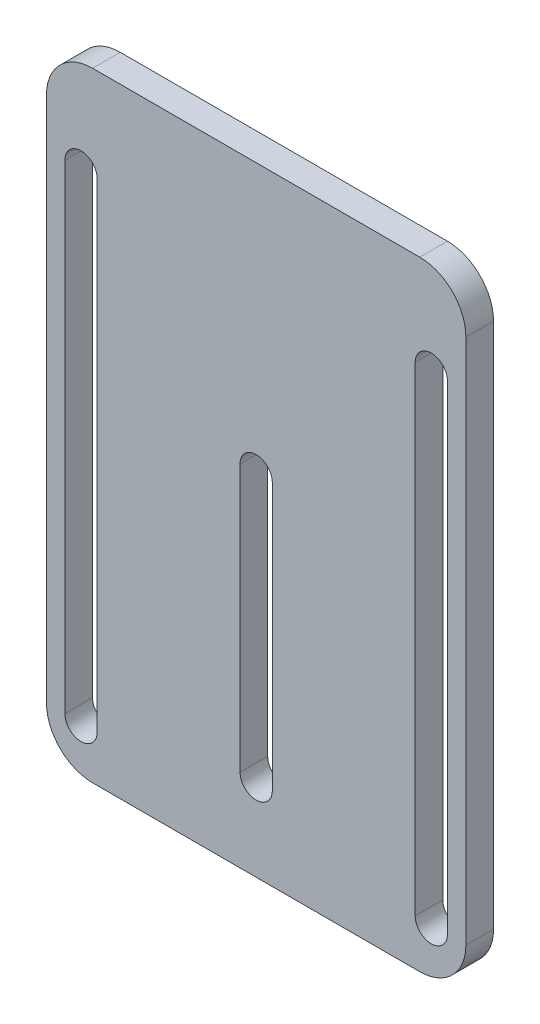
ISO-10303-21;
HEADER;
FILE_DESCRIPTION(('STEP AP214'),'2;1');
FILE_NAME('part.step','',(''),(''),'','','');
FILE_SCHEMA(('AUTOMOTIVE_DESIGN { 1 0 10303 214 1 1 1 1 }'));
ENDSEC;
DATA;
#1=APPLICATION_CONTEXT('core data for automotive mechanical design processes');
#2=APPLICATION_PROTOCOL_DEFINITION('international standard','automotive_design',2000,#1);
#3=PRODUCT_CONTEXT('',#1,'mechanical');
#4=PRODUCT('Part','Part','',(#3));
#5=PRODUCT_RELATED_PRODUCT_CATEGORY('part','',(#4));
#6=PRODUCT_DEFINITION_FORMATION('','',#4);
#7=PRODUCT_DEFINITION_CONTEXT('part definition',#1,'design');
#8=PRODUCT_DEFINITION('design','',#6,#7);
#9=PRODUCT_DEFINITION_SHAPE('','',#8);
#10=(LENGTH_UNIT() NAMED_UNIT(*) SI_UNIT(.MILLI.,.METRE.));
#11=(NAMED_UNIT(*) PLANE_ANGLE_UNIT() SI_UNIT($,.RADIAN.));
#12=(NAMED_UNIT(*) SI_UNIT($,.STERADIAN.) SOLID_ANGLE_UNIT());
#13=UNCERTAINTY_MEASURE_WITH_UNIT(LENGTH_MEASURE(1.E-05),#10,'distance_accuracy_value','');
#14=(GEOMETRIC_REPRESENTATION_CONTEXT(3) GLOBAL_UNCERTAINTY_ASSIGNED_CONTEXT((#13)) GLOBAL_UNIT_ASSIGNED_CONTEXT((#10,
#11,#12)) REPRESENTATION_CONTEXT('',''));
#15=CARTESIAN_POINT('',(0.,0.,0.));
#16=DIRECTION('',(0.,0.,1.));
#17=DIRECTION('',(1.,0.,0.));
#18=AXIS2_PLACEMENT_3D('',#15,#16,#17);
#19=CARTESIAN_POINT('',(-35.5,57.1361778440787,6.));
#20=DIRECTION('',(0.,0.,-1.));
#21=DIRECTION('',(-1.,0.,0.));
#22=AXIS2_PLACEMENT_3D('',#19,#20,#21);
#23=PLANE('',#22);
#24=CARTESIAN_POINT('',(38.,-57.1361778440787,6.));
#25=DIRECTION('',(0.,0.,1.));
#26=DIRECTION('',(1.,0.,0.));
#27=AXIS2_PLACEMENT_3D('',#24,#25,#26);
#28=CIRCLE('',#27,3.5);
#29=CARTESIAN_POINT('',(34.5,-57.1361778440787,6.));
#30=VERTEX_POINT('',#29);
#31=CARTESIAN_POINT('',(41.5,-57.1361778440787,6.));
#32=VERTEX_POINT('',#31);
#33=EDGE_CURVE('E206',#30,#32,#28,.T.);
#34=ORIENTED_EDGE('',*,*,#33,.F.);
#35=DIRECTION('',(0.,-1.,0.));
#36=VECTOR('',#35,1.);
#37=CARTESIAN_POINT('',(34.5,-57.1361778440787,6.));
#38=LINE('',#37,#36);
#39=CARTESIAN_POINT('',(34.5,46.8736456365923,6.));
#40=VERTEX_POINT('',#39);
#41=EDGE_CURVE('E214',#40,#30,#38,.T.);
#42=ORIENTED_EDGE('',*,*,#41,.F.);
#43=CARTESIAN_POINT('',(38.,46.8736456365923,6.));
#44=DIRECTION('',(0.,0.,1.));
#45=DIRECTION('',(1.,0.,0.));
#46=AXIS2_PLACEMENT_3D('',#43,#44,#45);
#47=CIRCLE('',#46,3.5);
#48=CARTESIAN_POINT('',(41.5,46.8736456365923,6.));
#49=VERTEX_POINT('',#48);
#50=EDGE_CURVE('E211',#49,#40,#47,.T.);
#51=ORIENTED_EDGE('',*,*,#50,.F.);
#52=DIRECTION('',(0.,1.,0.));
#53=VECTOR('',#52,1.);
#54=CARTESIAN_POINT('',(41.5,-57.1361778440787,6.));
#55=LINE('',#54,#53);
#56=EDGE_CURVE('E208',#32,#49,#55,.T.);
#57=ORIENTED_EDGE('',*,*,#56,.F.);
#58=EDGE_LOOP('',(#34,#42,#51,#57));
#59=FACE_BOUND('',#58,.T.);
#60=CARTESIAN_POINT('',(-35.5,57.1361778440787,6.));
#61=DIRECTION('',(0.,0.,1.));
#62=DIRECTION('',(-1.,0.,0.));
#63=AXIS2_PLACEMENT_3D('',#60,#61,#62);
#64=CIRCLE('',#63,10.);
#65=CARTESIAN_POINT('',(-35.5,67.1361778440787,6.));
#66=VERTEX_POINT('',#65);
#67=CARTESIAN_POINT('',(-45.5,57.1361778440787,6.));
#68=VERTEX_POINT('',#67);
#69=EDGE_CURVE('E268',#66,#68,#64,.T.);
#70=ORIENTED_EDGE('',*,*,#69,.T.);
#71=DIRECTION('',(0.,-1.,0.));
#72=VECTOR('',#71,1.);
#73=CARTESIAN_POINT('',(-45.5,-57.1361778440787,6.));
#74=LINE('',#73,#72);
#75=CARTESIAN_POINT('',(-45.5,-57.1361778440787,6.));
#76=VERTEX_POINT('',#75);
#77=EDGE_CURVE('E271',#68,#76,#74,.T.);
#78=ORIENTED_EDGE('',*,*,#77,.T.);
#79=CARTESIAN_POINT('',(-35.5,-57.1361778440787,6.));
#80=DIRECTION('',(0.,0.,1.));
#81=DIRECTION('',(-1.,0.,0.));
#82=AXIS2_PLACEMENT_3D('',#79,#80,#81);
#83=CIRCLE('',#82,9.99999999999999);
#84=CARTESIAN_POINT('',(-35.5,-67.1361778440787,6.));
#85=VERTEX_POINT('',#84);
#86=EDGE_CURVE('E274',#76,#85,#83,.T.);
#87=ORIENTED_EDGE('',*,*,#86,.T.);
#88=DIRECTION('',(1.,0.,0.));
#89=VECTOR('',#88,1.);
#90=CARTESIAN_POINT('',(-35.5,-67.1361778440787,6.));
#91=LINE('',#90,#89);
#92=CARTESIAN_POINT('',(35.5,-67.1361778440787,6.));
#93=VERTEX_POINT('',#92);
#94=EDGE_CURVE('E276',#85,#93,#91,.T.);
#95=ORIENTED_EDGE('',*,*,#94,.T.);
#96=CARTESIAN_POINT('',(35.5,-57.1361778440787,6.));
#97=DIRECTION('',(0.,0.,1.));
#98=DIRECTION('',(1.,0.,0.));
#99=AXIS2_PLACEMENT_3D('',#96,#97,#98);
#100=CIRCLE('',#99,9.99999999999999);
#101=CARTESIAN_POINT('',(45.5,-57.1361778440787,6.));
#102=VERTEX_POINT('',#101);
#103=EDGE_CURVE('E278',#93,#102,#100,.T.);
#104=ORIENTED_EDGE('',*,*,#103,.T.);
#105=DIRECTION('',(0.,1.,0.));
#106=VECTOR('',#105,1.);
#107=CARTESIAN_POINT('',(45.5,-57.1361778440787,6.));
#108=LINE('',#107,#106);
#109=CARTESIAN_POINT('',(45.5,57.1361778440787,6.));
#110=VERTEX_POINT('',#109);
#111=EDGE_CURVE('E280',#102,#110,#108,.T.);
#112=ORIENTED_EDGE('',*,*,#111,.T.);
#113=CARTESIAN_POINT('',(35.5,57.1361778440787,6.));
#114=DIRECTION('',(0.,0.,1.));
#115=DIRECTION('',(-1.,0.,0.));
#116=AXIS2_PLACEMENT_3D('',#113,#114,#115);
#117=CIRCLE('',#116,10.);
#118=CARTESIAN_POINT('',(35.5,67.1361778440787,6.));
#119=VERTEX_POINT('',#118);
#120=EDGE_CURVE('E282',#110,#119,#117,.T.);
#121=ORIENTED_EDGE('',*,*,#120,.T.);
#122=DIRECTION('',(-1.,0.,0.));
#123=VECTOR('',#122,1.);
#124=CARTESIAN_POINT('',(-35.5,67.1361778440787,6.));
#125=LINE('',#124,#123);
#126=EDGE_CURVE('E284',#119,#66,#125,.T.);
#127=ORIENTED_EDGE('',*,*,#126,.T.);
#128=EDGE_LOOP('',(#70,#78,#87,#95,#104,#112,#121,#127));
#129=FACE_BOUND('',#128,.T.);
#130=CARTESIAN_POINT('',(-38.,46.8736456365923,6.));
#131=DIRECTION('',(0.,0.,1.));
#132=DIRECTION('',(1.,0.,0.));
#133=AXIS2_PLACEMENT_3D('',#130,#131,#132);
#134=CIRCLE('',#133,3.5);
#135=CARTESIAN_POINT('',(-34.5,46.8736456365923,6.));
#136=VERTEX_POINT('',#135);
#137=CARTESIAN_POINT('',(-41.5,46.8736456365923,6.));
#138=VERTEX_POINT('',#137);
#139=EDGE_CURVE('E237',#136,#138,#134,.T.);
#140=ORIENTED_EDGE('',*,*,#139,.F.);
#141=DIRECTION('',(0.,1.,0.));
#142=VECTOR('',#141,1.);
#143=CARTESIAN_POINT('',(-34.5,46.8736456365923,6.));
#144=LINE('',#143,#142);
#145=CARTESIAN_POINT('',(-34.5,-57.1361778440787,6.));
#146=VERTEX_POINT('',#145);
#147=EDGE_CURVE('E245',#146,#136,#144,.T.);
#148=ORIENTED_EDGE('',*,*,#147,.F.);
#149=CARTESIAN_POINT('',(-38.,-57.1361778440787,6.));
#150=DIRECTION('',(0.,0.,1.));
#151=DIRECTION('',(1.,0.,0.));
#152=AXIS2_PLACEMENT_3D('',#149,#150,#151);
#153=CIRCLE('',#152,3.5);
#154=CARTESIAN_POINT('',(-41.5,-57.1361778440787,6.));
#155=VERTEX_POINT('',#154);
#156=EDGE_CURVE('E242',#155,#146,#153,.T.);
#157=ORIENTED_EDGE('',*,*,#156,.F.);
#158=DIRECTION('',(0.,-1.,0.));
#159=VECTOR('',#158,1.);
#160=CARTESIAN_POINT('',(-41.5,46.8736456365923,6.));
#161=LINE('',#160,#159);
#162=EDGE_CURVE('E239',#138,#155,#161,.T.);
#163=ORIENTED_EDGE('',*,*,#162,.F.);
#164=EDGE_LOOP('',(#140,#148,#157,#163));
#165=FACE_BOUND('',#164,.T.);
#166=CARTESIAN_POINT('',(0.,8.79158155869231,6.));
#167=DIRECTION('',(0.,0.,1.));
#168=DIRECTION('',(1.,0.,0.));
#169=AXIS2_PLACEMENT_3D('',#166,#167,#168);
#170=CIRCLE('',#169,3.5);
#171=CARTESIAN_POINT('',(3.5,8.79158155869231,6.));
#172=VERTEX_POINT('',#171);
#173=CARTESIAN_POINT('',(-3.5,8.79158155869231,6.));
#174=VERTEX_POINT('',#173);
#175=EDGE_CURVE('E170',#172,#174,#170,.T.);
#176=ORIENTED_EDGE('',*,*,#175,.F.);
#177=DIRECTION('',(0.,1.,0.));
#178=VECTOR('',#177,1.);
#179=CARTESIAN_POINT('',(3.5,8.79158155869231,6.));
#180=LINE('',#179,#178);
#181=CARTESIAN_POINT('',(3.5,-49.1361778440787,6.));
#182=VERTEX_POINT('',#181);
#183=EDGE_CURVE('E192',#182,#172,#180,.T.);
#184=ORIENTED_EDGE('',*,*,#183,.F.);
#185=CARTESIAN_POINT('',(0.,-49.1361778440787,6.));
#186=DIRECTION('',(0.,0.,1.));
#187=DIRECTION('',(1.,0.,0.));
#188=AXIS2_PLACEMENT_3D('',#185,#186,#187);
#189=CIRCLE('',#188,3.5);
#190=CARTESIAN_POINT('',(-3.5,-49.1361778440787,6.));
#191=VERTEX_POINT('',#190);
#192=EDGE_CURVE('E190',#191,#182,#189,.T.);
#193=ORIENTED_EDGE('',*,*,#192,.F.);
#194=DIRECTION('',(0.,-1.,0.));
#195=VECTOR('',#194,1.);
#196=CARTESIAN_POINT('',(-3.5,8.79158155869231,6.));
#197=LINE('',#196,#195);
#198=EDGE_CURVE('E178',#174,#191,#197,.T.);
#199=ORIENTED_EDGE('',*,*,#198,.F.);
#200=EDGE_LOOP('',(#176,#184,#193,#199));
#201=FACE_BOUND('',#200,.T.);
#202=ADVANCED_FACE('F33',(#59,#129,#165,#201),#23,.F.);
#203=CARTESIAN_POINT('',(-35.5,57.1361778440787,0.));
#204=DIRECTION('',(0.,0.,-1.));
#205=DIRECTION('',(-1.,0.,0.));
#206=AXIS2_PLACEMENT_3D('',#203,#204,#205);
#207=PLANE('',#206);
#208=CARTESIAN_POINT('',(-35.5,57.1361778440787,0.));
#209=DIRECTION('',(0.,0.,1.));
#210=DIRECTION('',(-1.,0.,0.));
#211=AXIS2_PLACEMENT_3D('',#208,#209,#210);
#212=CIRCLE('',#211,10.);
#213=CARTESIAN_POINT('',(-35.5,67.1361778440787,0.));
#214=VERTEX_POINT('',#213);
#215=CARTESIAN_POINT('',(-45.5,57.1361778440787,0.));
#216=VERTEX_POINT('',#215);
#217=EDGE_CURVE('E267',#214,#216,#212,.T.);
#218=ORIENTED_EDGE('',*,*,#217,.F.);
#219=DIRECTION('',(-1.,0.,0.));
#220=VECTOR('',#219,1.);
#221=CARTESIAN_POINT('',(-35.5,67.1361778440787,0.));
#222=LINE('',#221,#220);
#223=CARTESIAN_POINT('',(35.5,67.1361778440787,0.));
#224=VERTEX_POINT('',#223);
#225=EDGE_CURVE('E272',#224,#214,#222,.T.);
#226=ORIENTED_EDGE('',*,*,#225,.F.);
#227=CARTESIAN_POINT('',(35.5,57.1361778440787,0.));
#228=DIRECTION('',(0.,0.,1.));
#229=DIRECTION('',(-1.,0.,0.));
#230=AXIS2_PLACEMENT_3D('',#227,#228,#229);
#231=CIRCLE('',#230,10.);
#232=CARTESIAN_POINT('',(45.5,57.1361778440787,0.));
#233=VERTEX_POINT('',#232);
#234=EDGE_CURVE('E299',#233,#224,#231,.T.);
#235=ORIENTED_EDGE('',*,*,#234,.F.);
#236=DIRECTION('',(0.,1.,0.));
#237=VECTOR('',#236,1.);
#238=CARTESIAN_POINT('',(45.5,-57.1361778440787,0.));
#239=LINE('',#238,#237);
#240=CARTESIAN_POINT('',(45.5,-57.1361778440787,0.));
#241=VERTEX_POINT('',#240);
#242=EDGE_CURVE('E297',#241,#233,#239,.T.);
#243=ORIENTED_EDGE('',*,*,#242,.F.);
#244=CARTESIAN_POINT('',(35.5,-57.1361778440787,0.));
#245=DIRECTION('',(0.,0.,1.));
#246=DIRECTION('',(1.,0.,0.));
#247=AXIS2_PLACEMENT_3D('',#244,#245,#246);
#248=CIRCLE('',#247,9.99999999999999);
#249=CARTESIAN_POINT('',(35.5,-67.1361778440787,0.));
#250=VERTEX_POINT('',#249);
#251=EDGE_CURVE('E295',#250,#241,#248,.T.);
#252=ORIENTED_EDGE('',*,*,#251,.F.);
#253=DIRECTION('',(1.,0.,0.));
#254=VECTOR('',#253,1.);
#255=CARTESIAN_POINT('',(-35.5,-67.1361778440787,0.));
#256=LINE('',#255,#254);
#257=CARTESIAN_POINT('',(-35.5,-67.1361778440787,0.));
#258=VERTEX_POINT('',#257);
#259=EDGE_CURVE('E293',#258,#250,#256,.T.);
#260=ORIENTED_EDGE('',*,*,#259,.F.);
#261=CARTESIAN_POINT('',(-35.5,-57.1361778440787,0.));
#262=DIRECTION('',(0.,0.,1.));
#263=DIRECTION('',(-1.,0.,0.));
#264=AXIS2_PLACEMENT_3D('',#261,#262,#263);
#265=CIRCLE('',#264,9.99999999999999);
#266=CARTESIAN_POINT('',(-45.5,-57.1361778440787,0.));
#267=VERTEX_POINT('',#266);
#268=EDGE_CURVE('E291',#267,#258,#265,.T.);
#269=ORIENTED_EDGE('',*,*,#268,.F.);
#270=DIRECTION('',(0.,-1.,0.));
#271=VECTOR('',#270,1.);
#272=CARTESIAN_POINT('',(-45.5,-57.1361778440787,0.));
#273=LINE('',#272,#271);
#274=EDGE_CURVE('E289',#216,#267,#273,.T.);
#275=ORIENTED_EDGE('',*,*,#274,.F.);
#276=EDGE_LOOP('',(#218,#226,#235,#243,#252,#260,#269,#275));
#277=FACE_BOUND('',#276,.T.);
#278=DIRECTION('',(0.,1.,0.));
#279=VECTOR('',#278,1.);
#280=CARTESIAN_POINT('',(-34.5,46.8736456365923,0.));
#281=LINE('',#280,#279);
#282=CARTESIAN_POINT('',(-34.5,-57.1361778440787,0.));
#283=VERTEX_POINT('',#282);
#284=CARTESIAN_POINT('',(-34.5,46.8736456365923,0.));
#285=VERTEX_POINT('',#284);
#286=EDGE_CURVE('E240',#283,#285,#281,.T.);
#287=ORIENTED_EDGE('',*,*,#286,.T.);
#288=CARTESIAN_POINT('',(-38.,46.8736456365923,0.));
#289=DIRECTION('',(0.,0.,1.));
#290=DIRECTION('',(1.,0.,0.));
#291=AXIS2_PLACEMENT_3D('',#288,#289,#290);
#292=CIRCLE('',#291,3.5);
#293=CARTESIAN_POINT('',(-41.5,46.8736456365923,0.));
#294=VERTEX_POINT('',#293);
#295=EDGE_CURVE('E236',#285,#294,#292,.T.);
#296=ORIENTED_EDGE('',*,*,#295,.T.);
#297=DIRECTION('',(0.,-1.,0.));
#298=VECTOR('',#297,1.);
#299=CARTESIAN_POINT('',(-41.5,46.8736456365923,0.));
#300=LINE('',#299,#298);
#301=CARTESIAN_POINT('',(-41.5,-57.1361778440787,0.));
#302=VERTEX_POINT('',#301);
#303=EDGE_CURVE('E250',#294,#302,#300,.T.);
#304=ORIENTED_EDGE('',*,*,#303,.T.);
#305=CARTESIAN_POINT('',(-38.,-57.1361778440787,0.));
#306=DIRECTION('',(0.,0.,1.));
#307=DIRECTION('',(1.,0.,0.));
#308=AXIS2_PLACEMENT_3D('',#305,#306,#307);
#309=CIRCLE('',#308,3.5);
#310=EDGE_CURVE('E253',#302,#283,#309,.T.);
#311=ORIENTED_EDGE('',*,*,#310,.T.);
#312=EDGE_LOOP('',(#287,#296,#304,#311));
#313=FACE_BOUND('',#312,.T.);
#314=DIRECTION('',(0.,-1.,0.));
#315=VECTOR('',#314,1.);
#316=CARTESIAN_POINT('',(34.5,-57.1361778440787,0.));
#317=LINE('',#316,#315);
#318=CARTESIAN_POINT('',(34.5,46.8736456365923,0.));
#319=VERTEX_POINT('',#318);
#320=CARTESIAN_POINT('',(34.5,-57.1361778440787,0.));
#321=VERTEX_POINT('',#320);
#322=EDGE_CURVE('E209',#319,#321,#317,.T.);
#323=ORIENTED_EDGE('',*,*,#322,.T.);
#324=CARTESIAN_POINT('',(38.,-57.1361778440787,0.));
#325=DIRECTION('',(0.,0.,1.));
#326=DIRECTION('',(1.,0.,0.));
#327=AXIS2_PLACEMENT_3D('',#324,#325,#326);
#328=CIRCLE('',#327,3.5);
#329=CARTESIAN_POINT('',(41.5,-57.1361778440787,0.));
#330=VERTEX_POINT('',#329);
#331=EDGE_CURVE('E186',#321,#330,#328,.T.);
#332=ORIENTED_EDGE('',*,*,#331,.T.);
#333=DIRECTION('',(0.,1.,0.));
#334=VECTOR('',#333,1.);
#335=CARTESIAN_POINT('',(41.5,-57.1361778440787,0.));
#336=LINE('',#335,#334);
#337=CARTESIAN_POINT('',(41.5,46.8736456365923,0.));
#338=VERTEX_POINT('',#337);
#339=EDGE_CURVE('E219',#330,#338,#336,.T.);
#340=ORIENTED_EDGE('',*,*,#339,.T.);
#341=CARTESIAN_POINT('',(38.,46.8736456365923,0.));
#342=DIRECTION('',(0.,0.,1.));
#343=DIRECTION('',(1.,0.,0.));
#344=AXIS2_PLACEMENT_3D('',#341,#342,#343);
#345=CIRCLE('',#344,3.5);
#346=EDGE_CURVE('E222',#338,#319,#345,.T.);
#347=ORIENTED_EDGE('',*,*,#346,.T.);
#348=EDGE_LOOP('',(#323,#332,#340,#347));
#349=FACE_BOUND('',#348,.T.);
#350=DIRECTION('',(0.,1.,0.));
#351=VECTOR('',#350,1.);
#352=CARTESIAN_POINT('',(3.5,8.79158155869231,0.));
#353=LINE('',#352,#351);
#354=CARTESIAN_POINT('',(3.5,-49.1361778440787,0.));
#355=VERTEX_POINT('',#354);
#356=CARTESIAN_POINT('',(3.5,8.79158155869231,0.));
#357=VERTEX_POINT('',#356);
#358=EDGE_CURVE('E179',#355,#357,#353,.T.);
#359=ORIENTED_EDGE('',*,*,#358,.T.);
#360=CARTESIAN_POINT('',(0.,8.79158155869231,0.));
#361=DIRECTION('',(0.,0.,1.));
#362=DIRECTION('',(1.,0.,0.));
#363=AXIS2_PLACEMENT_3D('',#360,#361,#362);
#364=CIRCLE('',#363,3.5);
#365=CARTESIAN_POINT('',(-3.5,8.79158155869231,0.));
#366=VERTEX_POINT('',#365);
#367=EDGE_CURVE('E56',#357,#366,#364,.T.);
#368=ORIENTED_EDGE('',*,*,#367,.T.);
#369=DIRECTION('',(0.,-1.,0.));
#370=VECTOR('',#369,1.);
#371=CARTESIAN_POINT('',(-3.5,8.79158155869231,0.));
#372=LINE('',#371,#370);
#373=CARTESIAN_POINT('',(-3.5,-49.1361778440787,0.));
#374=VERTEX_POINT('',#373);
#375=EDGE_CURVE('E185',#366,#374,#372,.T.);
#376=ORIENTED_EDGE('',*,*,#375,.T.);
#377=CARTESIAN_POINT('',(0.,-49.1361778440787,0.));
#378=DIRECTION('',(0.,0.,1.));
#379=DIRECTION('',(1.,0.,0.));
#380=AXIS2_PLACEMENT_3D('',#377,#378,#379);
#381=CIRCLE('',#380,3.5);
#382=EDGE_CURVE('E198',#374,#355,#381,.T.);
#383=ORIENTED_EDGE('',*,*,#382,.T.);
#384=EDGE_LOOP('',(#359,#368,#376,#383));
#385=FACE_BOUND('',#384,.T.);
#386=ADVANCED_FACE('F329',(#277,#313,#349,#385),#207,.T.);
#387=CARTESIAN_POINT('',(-35.5,57.1361778440787,6.));
#388=DIRECTION('',(0.,0.,-1.));
#389=DIRECTION('',(-1.,0.,0.));
#390=AXIS2_PLACEMENT_3D('',#387,#388,#389);
#391=CYLINDRICAL_SURFACE('',#390,10.);
#392=ORIENTED_EDGE('',*,*,#217,.T.);
#393=DIRECTION('',(0.,0.,-1.));
#394=VECTOR('',#393,1.);
#395=CARTESIAN_POINT('',(-45.5,57.1361778440787,6.));
#396=LINE('',#395,#394);
#397=EDGE_CURVE('E11',#68,#216,#396,.T.);
#398=ORIENTED_EDGE('',*,*,#397,.F.);
#399=ORIENTED_EDGE('',*,*,#69,.F.);
#400=DIRECTION('',(0.,0.,-1.));
#401=VECTOR('',#400,1.);
#402=CARTESIAN_POINT('',(-35.5,67.1361778440787,6.));
#403=LINE('',#402,#401);
#404=EDGE_CURVE('E286',#66,#214,#403,.T.);
#405=ORIENTED_EDGE('',*,*,#404,.T.);
#406=EDGE_LOOP('',(#392,#398,#399,#405));
#407=FACE_BOUND('',#406,.T.);
#408=ADVANCED_FACE('F35',(#407),#391,.T.);
#409=CARTESIAN_POINT('',(-45.5,-57.1361778440787,6.));
#410=DIRECTION('',(1.,0.,0.));
#411=DIRECTION('',(0.,0.,-1.));
#412=AXIS2_PLACEMENT_3D('',#409,#410,#411);
#413=PLANE('',#412);
#414=ORIENTED_EDGE('',*,*,#274,.T.);
#415=DIRECTION('',(0.,0.,-1.));
#416=VECTOR('',#415,1.);
#417=CARTESIAN_POINT('',(-45.5,-57.1361778440787,6.));
#418=LINE('',#417,#416);
#419=EDGE_CURVE('E41',#76,#267,#418,.T.);
#420=ORIENTED_EDGE('',*,*,#419,.F.);
#421=ORIENTED_EDGE('',*,*,#77,.F.);
#422=ORIENTED_EDGE('',*,*,#397,.T.);
#423=EDGE_LOOP('',(#414,#420,#421,#422));
#424=FACE_BOUND('',#423,.T.);
#425=ADVANCED_FACE('F347',(#424),#413,.F.);
#426=CARTESIAN_POINT('',(-35.5,-57.1361778440787,6.));
#427=DIRECTION('',(0.,0.,-1.));
#428=DIRECTION('',(-1.,0.,0.));
#429=AXIS2_PLACEMENT_3D('',#426,#427,#428);
#430=CYLINDRICAL_SURFACE('',#429,9.99999999999999);
#431=ORIENTED_EDGE('',*,*,#268,.T.);
#432=DIRECTION('',(0.,0.,-1.));
#433=VECTOR('',#432,1.);
#434=CARTESIAN_POINT('',(-35.5,-67.1361778440787,6.));
#435=LINE('',#434,#433);
#436=EDGE_CURVE('E316',#85,#258,#435,.T.);
#437=ORIENTED_EDGE('',*,*,#436,.F.);
#438=ORIENTED_EDGE('',*,*,#86,.F.);
#439=ORIENTED_EDGE('',*,*,#419,.T.);
#440=EDGE_LOOP('',(#431,#437,#438,#439));
#441=FACE_BOUND('',#440,.T.);
#442=ADVANCED_FACE('F323',(#441),#430,.T.);
#443=CARTESIAN_POINT('',(-35.5,-67.1361778440787,6.));
#444=DIRECTION('',(0.,1.,0.));
#445=DIRECTION('',(0.,0.,1.));
#446=AXIS2_PLACEMENT_3D('',#443,#444,#445);
#447=PLANE('',#446);
#448=ORIENTED_EDGE('',*,*,#259,.T.);
#449=DIRECTION('',(0.,0.,-1.));
#450=VECTOR('',#449,1.);
#451=CARTESIAN_POINT('',(35.5,-67.1361778440787,6.));
#452=LINE('',#451,#450);
#453=EDGE_CURVE('E313',#93,#250,#452,.T.);
#454=ORIENTED_EDGE('',*,*,#453,.F.);
#455=ORIENTED_EDGE('',*,*,#94,.F.);
#456=ORIENTED_EDGE('',*,*,#436,.T.);
#457=EDGE_LOOP('',(#448,#454,#455,#456));
#458=FACE_BOUND('',#457,.T.);
#459=ADVANCED_FACE('F335',(#458),#447,.F.);
#460=CARTESIAN_POINT('',(35.5,-57.1361778440787,6.));
#461=DIRECTION('',(0.,0.,-1.));
#462=DIRECTION('',(-1.,0.,0.));
#463=AXIS2_PLACEMENT_3D('',#460,#461,#462);
#464=CYLINDRICAL_SURFACE('',#463,9.99999999999999);
#465=ORIENTED_EDGE('',*,*,#251,.T.);
#466=DIRECTION('',(0.,0.,-1.));
#467=VECTOR('',#466,1.);
#468=CARTESIAN_POINT('',(45.5,-57.1361778440787,6.));
#469=LINE('',#468,#467);
#470=EDGE_CURVE('E310',#102,#241,#469,.T.);
#471=ORIENTED_EDGE('',*,*,#470,.F.);
#472=ORIENTED_EDGE('',*,*,#103,.F.);
#473=ORIENTED_EDGE('',*,*,#453,.T.);
#474=EDGE_LOOP('',(#465,#471,#472,#473));
#475=FACE_BOUND('',#474,.T.);
#476=ADVANCED_FACE('F339',(#475),#464,.T.);
#477=CARTESIAN_POINT('',(45.5,-57.1361778440787,6.));
#478=DIRECTION('',(-1.,0.,0.));
#479=DIRECTION('',(0.,0.,1.));
#480=AXIS2_PLACEMENT_3D('',#477,#478,#479);
#481=PLANE('',#480);
#482=ORIENTED_EDGE('',*,*,#242,.T.);
#483=DIRECTION('',(0.,0.,-1.));
#484=VECTOR('',#483,1.);
#485=CARTESIAN_POINT('',(45.5,57.1361778440787,6.));
#486=LINE('',#485,#484);
#487=EDGE_CURVE('E307',#110,#233,#486,.T.);
#488=ORIENTED_EDGE('',*,*,#487,.F.);
#489=ORIENTED_EDGE('',*,*,#111,.F.);
#490=ORIENTED_EDGE('',*,*,#470,.T.);
#491=EDGE_LOOP('',(#482,#488,#489,#490));
#492=FACE_BOUND('',#491,.T.);
#493=ADVANCED_FACE('F360',(#492),#481,.F.);
#494=CARTESIAN_POINT('',(35.5,57.1361778440787,6.));
#495=DIRECTION('',(0.,0.,-1.));
#496=DIRECTION('',(-1.,0.,0.));
#497=AXIS2_PLACEMENT_3D('',#494,#495,#496);
#498=CYLINDRICAL_SURFACE('',#497,10.);
#499=ORIENTED_EDGE('',*,*,#234,.T.);
#500=DIRECTION('',(0.,0.,-1.));
#501=VECTOR('',#500,1.);
#502=CARTESIAN_POINT('',(35.5,67.1361778440787,6.));
#503=LINE('',#502,#501);
#504=EDGE_CURVE('E304',#119,#224,#503,.T.);
#505=ORIENTED_EDGE('',*,*,#504,.F.);
#506=ORIENTED_EDGE('',*,*,#120,.F.);
#507=ORIENTED_EDGE('',*,*,#487,.T.);
#508=EDGE_LOOP('',(#499,#505,#506,#507));
#509=FACE_BOUND('',#508,.T.);
#510=ADVANCED_FACE('F358',(#509),#498,.T.);
#511=CARTESIAN_POINT('',(-35.5,67.1361778440787,6.));
#512=DIRECTION('',(0.,-1.,0.));
#513=DIRECTION('',(0.,0.,-1.));
#514=AXIS2_PLACEMENT_3D('',#511,#512,#513);
#515=PLANE('',#514);
#516=ORIENTED_EDGE('',*,*,#225,.T.);
#517=ORIENTED_EDGE('',*,*,#404,.F.);
#518=ORIENTED_EDGE('',*,*,#126,.F.);
#519=ORIENTED_EDGE('',*,*,#504,.T.);
#520=EDGE_LOOP('',(#516,#517,#518,#519));
#521=FACE_BOUND('',#520,.T.);
#522=ADVANCED_FACE('F353',(#521),#515,.F.);
#523=CARTESIAN_POINT('',(-38.,46.8736456365923,6.));
#524=DIRECTION('',(0.,0.,-1.));
#525=DIRECTION('',(-1.,0.,0.));
#526=AXIS2_PLACEMENT_3D('',#523,#524,#525);
#527=CYLINDRICAL_SURFACE('',#526,3.5);
#528=ORIENTED_EDGE('',*,*,#295,.F.);
#529=DIRECTION('',(0.,0.,-1.));
#530=VECTOR('',#529,1.);
#531=CARTESIAN_POINT('',(-34.5,46.8736456365923,6.));
#532=LINE('',#531,#530);
#533=EDGE_CURVE('E247',#136,#285,#532,.T.);
#534=ORIENTED_EDGE('',*,*,#533,.F.);
#535=ORIENTED_EDGE('',*,*,#139,.T.);
#536=DIRECTION('',(0.,0.,-1.));
#537=VECTOR('',#536,1.);
#538=CARTESIAN_POINT('',(-41.5,46.8736456365923,6.));
#539=LINE('',#538,#537);
#540=EDGE_CURVE('E264',#138,#294,#539,.T.);
#541=ORIENTED_EDGE('',*,*,#540,.T.);
#542=EDGE_LOOP('',(#528,#534,#535,#541));
#543=FACE_BOUND('',#542,.T.);
#544=ADVANCED_FACE('F378',(#543),#527,.F.);
#545=CARTESIAN_POINT('',(-41.5,46.8736456365923,6.));
#546=DIRECTION('',(1.,0.,0.));
#547=DIRECTION('',(0.,0.,-1.));
#548=AXIS2_PLACEMENT_3D('',#545,#546,#547);
#549=PLANE('',#548);
#550=ORIENTED_EDGE('',*,*,#303,.F.);
#551=ORIENTED_EDGE('',*,*,#540,.F.);
#552=ORIENTED_EDGE('',*,*,#162,.T.);
#553=DIRECTION('',(0.,0.,-1.));
#554=VECTOR('',#553,1.);
#555=CARTESIAN_POINT('',(-41.5,-57.1361778440787,6.));
#556=LINE('',#555,#554);
#557=EDGE_CURVE('E262',#155,#302,#556,.T.);
#558=ORIENTED_EDGE('',*,*,#557,.T.);
#559=EDGE_LOOP('',(#550,#551,#552,#558));
#560=FACE_BOUND('',#559,.T.);
#561=ADVANCED_FACE('F385',(#560),#549,.T.);
#562=CARTESIAN_POINT('',(-38.,-57.1361778440787,6.));
#563=DIRECTION('',(0.,0.,-1.));
#564=DIRECTION('',(-1.,0.,0.));
#565=AXIS2_PLACEMENT_3D('',#562,#563,#564);
#566=CYLINDRICAL_SURFACE('',#565,3.5);
#567=ORIENTED_EDGE('',*,*,#310,.F.);
#568=ORIENTED_EDGE('',*,*,#557,.F.);
#569=ORIENTED_EDGE('',*,*,#156,.T.);
#570=DIRECTION('',(0.,0.,-1.));
#571=VECTOR('',#570,1.);
#572=CARTESIAN_POINT('',(-34.5,-57.1361778440787,6.));
#573=LINE('',#572,#571);
#574=EDGE_CURVE('E260',#146,#283,#573,.T.);
#575=ORIENTED_EDGE('',*,*,#574,.T.);
#576=EDGE_LOOP('',(#567,#568,#569,#575));
#577=FACE_BOUND('',#576,.T.);
#578=ADVANCED_FACE('F390',(#577),#566,.F.);
#579=CARTESIAN_POINT('',(-34.5,46.8736456365923,6.));
#580=DIRECTION('',(-1.,0.,0.));
#581=DIRECTION('',(0.,0.,1.));
#582=AXIS2_PLACEMENT_3D('',#579,#580,#581);
#583=PLANE('',#582);
#584=ORIENTED_EDGE('',*,*,#286,.F.);
#585=ORIENTED_EDGE('',*,*,#574,.F.);
#586=ORIENTED_EDGE('',*,*,#147,.T.);
#587=ORIENTED_EDGE('',*,*,#533,.T.);
#588=EDGE_LOOP('',(#584,#585,#586,#587));
#589=FACE_BOUND('',#588,.T.);
#590=ADVANCED_FACE('F397',(#589),#583,.T.);
#591=CARTESIAN_POINT('',(38.,-57.1361778440787,6.));
#592=DIRECTION('',(0.,0.,-1.));
#593=DIRECTION('',(-1.,0.,0.));
#594=AXIS2_PLACEMENT_3D('',#591,#592,#593);
#595=CYLINDRICAL_SURFACE('',#594,3.5);
#596=ORIENTED_EDGE('',*,*,#331,.F.);
#597=DIRECTION('',(0.,0.,-1.));
#598=VECTOR('',#597,1.);
#599=CARTESIAN_POINT('',(34.5,-57.1361778440787,6.));
#600=LINE('',#599,#598);
#601=EDGE_CURVE('E216',#30,#321,#600,.T.);
#602=ORIENTED_EDGE('',*,*,#601,.F.);
#603=ORIENTED_EDGE('',*,*,#33,.T.);
#604=DIRECTION('',(0.,0.,-1.));
#605=VECTOR('',#604,1.);
#606=CARTESIAN_POINT('',(41.5,-57.1361778440787,6.));
#607=LINE('',#606,#605);
#608=EDGE_CURVE('E233',#32,#330,#607,.T.);
#609=ORIENTED_EDGE('',*,*,#608,.T.);
#610=EDGE_LOOP('',(#596,#602,#603,#609));
#611=FACE_BOUND('',#610,.T.);
#612=ADVANCED_FACE('F410',(#611),#595,.F.);
#613=CARTESIAN_POINT('',(41.5,-57.1361778440787,6.));
#614=DIRECTION('',(-1.,0.,0.));
#615=DIRECTION('',(0.,0.,1.));
#616=AXIS2_PLACEMENT_3D('',#613,#614,#615);
#617=PLANE('',#616);
#618=ORIENTED_EDGE('',*,*,#339,.F.);
#619=ORIENTED_EDGE('',*,*,#608,.F.);
#620=ORIENTED_EDGE('',*,*,#56,.T.);
#621=DIRECTION('',(0.,0.,-1.));
#622=VECTOR('',#621,1.);
#623=CARTESIAN_POINT('',(41.5,46.8736456365923,6.));
#624=LINE('',#623,#622);
#625=EDGE_CURVE('E231',#49,#338,#624,.T.);
#626=ORIENTED_EDGE('',*,*,#625,.T.);
#627=EDGE_LOOP('',(#618,#619,#620,#626));
#628=FACE_BOUND('',#627,.T.);
#629=ADVANCED_FACE('F415',(#628),#617,.T.);
#630=CARTESIAN_POINT('',(38.,46.8736456365923,6.));
#631=DIRECTION('',(0.,0.,-1.));
#632=DIRECTION('',(-1.,0.,0.));
#633=AXIS2_PLACEMENT_3D('',#630,#631,#632);
#634=CYLINDRICAL_SURFACE('',#633,3.5);
#635=ORIENTED_EDGE('',*,*,#346,.F.);
#636=ORIENTED_EDGE('',*,*,#625,.F.);
#637=ORIENTED_EDGE('',*,*,#50,.T.);
#638=DIRECTION('',(0.,0.,-1.));
#639=VECTOR('',#638,1.);
#640=CARTESIAN_POINT('',(34.5,46.8736456365923,6.));
#641=LINE('',#640,#639);
#642=EDGE_CURVE('E229',#40,#319,#641,.T.);
#643=ORIENTED_EDGE('',*,*,#642,.T.);
#644=EDGE_LOOP('',(#635,#636,#637,#643));
#645=FACE_BOUND('',#644,.T.);
#646=ADVANCED_FACE('F419',(#645),#634,.F.);
#647=CARTESIAN_POINT('',(34.5,-57.1361778440787,6.));
#648=DIRECTION('',(1.,0.,0.));
#649=DIRECTION('',(0.,0.,-1.));
#650=AXIS2_PLACEMENT_3D('',#647,#648,#649);
#651=PLANE('',#650);
#652=ORIENTED_EDGE('',*,*,#322,.F.);
#653=ORIENTED_EDGE('',*,*,#642,.F.);
#654=ORIENTED_EDGE('',*,*,#41,.T.);
#655=ORIENTED_EDGE('',*,*,#601,.T.);
#656=EDGE_LOOP('',(#652,#653,#654,#655));
#657=FACE_BOUND('',#656,.T.);
#658=ADVANCED_FACE('F423',(#657),#651,.T.);
#659=CARTESIAN_POINT('',(0.,8.79158155869231,6.));
#660=DIRECTION('',(0.,0.,-1.));
#661=DIRECTION('',(-1.,0.,0.));
#662=AXIS2_PLACEMENT_3D('',#659,#660,#661);
#663=CYLINDRICAL_SURFACE('',#662,3.5);
#664=ORIENTED_EDGE('',*,*,#367,.F.);
#665=DIRECTION('',(0.,0.,-1.));
#666=VECTOR('',#665,1.);
#667=CARTESIAN_POINT('',(3.5,8.79158155869231,6.));
#668=LINE('',#667,#666);
#669=EDGE_CURVE('E174',#172,#357,#668,.T.);
#670=ORIENTED_EDGE('',*,*,#669,.F.);
#671=ORIENTED_EDGE('',*,*,#175,.T.);
#672=DIRECTION('',(0.,0.,-1.));
#673=VECTOR('',#672,1.);
#674=CARTESIAN_POINT('',(-3.5,8.79158155869231,6.));
#675=LINE('',#674,#673);
#676=EDGE_CURVE('E173',#174,#366,#675,.T.);
#677=ORIENTED_EDGE('',*,*,#676,.T.);
#678=EDGE_LOOP('',(#664,#670,#671,#677));
#679=FACE_BOUND('',#678,.T.);
#680=ADVANCED_FACE('F172',(#679),#663,.F.);
#681=CARTESIAN_POINT('',(-3.5,8.79158155869231,6.));
#682=DIRECTION('',(1.,0.,0.));
#683=DIRECTION('',(0.,0.,-1.));
#684=AXIS2_PLACEMENT_3D('',#681,#682,#683);
#685=PLANE('',#684);
#686=ORIENTED_EDGE('',*,*,#375,.F.);
#687=ORIENTED_EDGE('',*,*,#676,.F.);
#688=ORIENTED_EDGE('',*,*,#198,.T.);
#689=DIRECTION('',(0.,0.,-1.));
#690=VECTOR('',#689,1.);
#691=CARTESIAN_POINT('',(-3.5,-49.1361778440787,6.));
#692=LINE('',#691,#690);
#693=EDGE_CURVE('E187',#191,#374,#692,.T.);
#694=ORIENTED_EDGE('',*,*,#693,.T.);
#695=EDGE_LOOP('',(#686,#687,#688,#694));
#696=FACE_BOUND('',#695,.T.);
#697=ADVANCED_FACE('F182',(#696),#685,.T.);
#698=CARTESIAN_POINT('',(0.,-49.1361778440787,6.));
#699=DIRECTION('',(0.,0.,-1.));
#700=DIRECTION('',(-1.,0.,0.));
#701=AXIS2_PLACEMENT_3D('',#698,#699,#700);
#702=CYLINDRICAL_SURFACE('',#701,3.5);
#703=ORIENTED_EDGE('',*,*,#382,.F.);
#704=ORIENTED_EDGE('',*,*,#693,.F.);
#705=ORIENTED_EDGE('',*,*,#192,.T.);
#706=DIRECTION('',(0.,0.,-1.));
#707=VECTOR('',#706,1.);
#708=CARTESIAN_POINT('',(3.5,-49.1361778440787,6.));
#709=LINE('',#708,#707);
#710=EDGE_CURVE('E48',#182,#355,#709,.T.);
#711=ORIENTED_EDGE('',*,*,#710,.T.);
#712=EDGE_LOOP('',(#703,#704,#705,#711));
#713=FACE_BOUND('',#712,.T.);
#714=ADVANCED_FACE('F432',(#713),#702,.F.);
#715=CARTESIAN_POINT('',(3.5,8.79158155869231,6.));
#716=DIRECTION('',(-1.,0.,0.));
#717=DIRECTION('',(0.,0.,1.));
#718=AXIS2_PLACEMENT_3D('',#715,#716,#717);
#719=PLANE('',#718);
#720=ORIENTED_EDGE('',*,*,#358,.F.);
#721=ORIENTED_EDGE('',*,*,#710,.F.);
#722=ORIENTED_EDGE('',*,*,#183,.T.);
#723=ORIENTED_EDGE('',*,*,#669,.T.);
#724=EDGE_LOOP('',(#720,#721,#722,#723));
#725=FACE_BOUND('',#724,.T.);
#726=ADVANCED_FACE('F435',(#725),#719,.T.);
#727=CLOSED_SHELL('',(#202,#386,#408,#425,#442,#459,#476,#493,#510,#522,#544,#561,#578,#590,
#612,#629,#646,#658,#680,#697,#714,#726));
#728=MANIFOLD_SOLID_BREP('B2',#727);
#729=ADVANCED_BREP_SHAPE_REPRESENTATION('',(#18,#728),#14);
#730=SHAPE_DEFINITION_REPRESENTATION(#9,#729);
ENDSEC;
END-ISO-10303-21;
